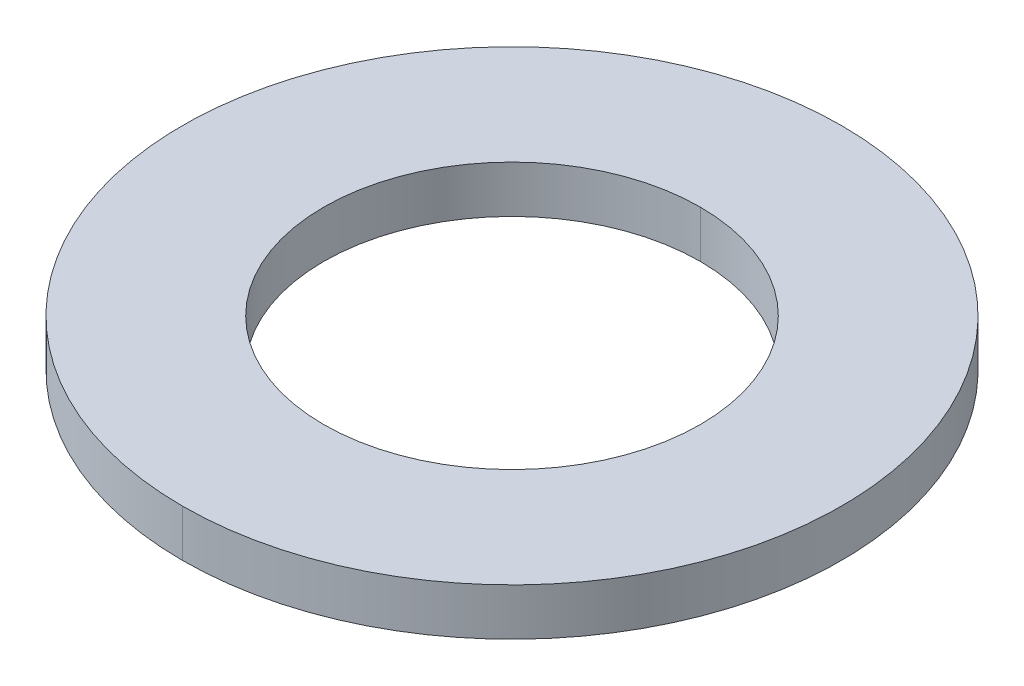
ISO-10303-21;
HEADER;
FILE_DESCRIPTION(('STEP AP214'),'2;1');
FILE_NAME('part.step','',(''),(''),'','','');
FILE_SCHEMA(('AUTOMOTIVE_DESIGN { 1 0 10303 214 1 1 1 1 }'));
ENDSEC;
DATA;
#1=APPLICATION_CONTEXT('core data for automotive mechanical design processes');
#2=APPLICATION_PROTOCOL_DEFINITION('international standard','automotive_design',2000,#1);
#3=PRODUCT_CONTEXT('',#1,'mechanical');
#4=PRODUCT('Part','Part','',(#3));
#5=PRODUCT_RELATED_PRODUCT_CATEGORY('part','',(#4));
#6=PRODUCT_DEFINITION_FORMATION('','',#4);
#7=PRODUCT_DEFINITION_CONTEXT('part definition',#1,'design');
#8=PRODUCT_DEFINITION('design','',#6,#7);
#9=PRODUCT_DEFINITION_SHAPE('','',#8);
#10=(LENGTH_UNIT() NAMED_UNIT(*) SI_UNIT(.MILLI.,.METRE.));
#11=(NAMED_UNIT(*) PLANE_ANGLE_UNIT() SI_UNIT($,.RADIAN.));
#12=(NAMED_UNIT(*) SI_UNIT($,.STERADIAN.) SOLID_ANGLE_UNIT());
#13=UNCERTAINTY_MEASURE_WITH_UNIT(LENGTH_MEASURE(1.E-05),#10,'distance_accuracy_value','');
#14=(GEOMETRIC_REPRESENTATION_CONTEXT(3) GLOBAL_UNCERTAINTY_ASSIGNED_CONTEXT((#13)) GLOBAL_UNIT_ASSIGNED_CONTEXT((#10,
#11,#12)) REPRESENTATION_CONTEXT('',''));
#15=CARTESIAN_POINT('',(0.,0.,0.));
#16=DIRECTION('',(0.,0.,1.));
#17=DIRECTION('',(1.,0.,0.));
#18=AXIS2_PLACEMENT_3D('',#15,#16,#17);
#19=CARTESIAN_POINT('',(0.,0.,0.));
#20=DIRECTION('',(0.,1.,0.));
#21=DIRECTION('',(0.,0.,1.));
#22=AXIS2_PLACEMENT_3D('',#19,#20,#21);
#23=CYLINDRICAL_SURFACE('',#22,4.);
#24=DIRECTION('',(0.,1.,0.));
#25=VECTOR('',#24,1.);
#26=CARTESIAN_POINT('',(0.,0.,-4.));
#27=LINE('',#26,#25);
#28=CARTESIAN_POINT('',(0.,0.,-4.));
#29=VERTEX_POINT('',#28);
#30=CARTESIAN_POINT('',(0.,1.,-4.));
#31=VERTEX_POINT('',#30);
#32=EDGE_CURVE('E20',#29,#31,#27,.T.);
#33=ORIENTED_EDGE('',*,*,#32,.F.);
#34=CARTESIAN_POINT('',(0.,0.,0.));
#35=DIRECTION('',(0.,1.,0.));
#36=DIRECTION('',(0.,0.,1.));
#37=AXIS2_PLACEMENT_3D('',#34,#35,#36);
#38=CIRCLE('',#37,4.);
#39=CARTESIAN_POINT('',(0.,0.,4.));
#40=VERTEX_POINT('',#39);
#41=EDGE_CURVE('E11',#40,#29,#38,.T.);
#42=ORIENTED_EDGE('',*,*,#41,.F.);
#43=DIRECTION('',(0.,1.,0.));
#44=VECTOR('',#43,1.);
#45=CARTESIAN_POINT('',(0.,0.,4.));
#46=LINE('',#45,#44);
#47=CARTESIAN_POINT('',(0.,1.,4.));
#48=VERTEX_POINT('',#47);
#49=EDGE_CURVE('E81',#40,#48,#46,.T.);
#50=ORIENTED_EDGE('',*,*,#49,.T.);
#51=CARTESIAN_POINT('',(0.,1.,0.));
#52=DIRECTION('',(0.,1.,0.));
#53=DIRECTION('',(0.,0.,1.));
#54=AXIS2_PLACEMENT_3D('',#51,#52,#53);
#55=CIRCLE('',#54,4.);
#56=EDGE_CURVE('E26',#48,#31,#55,.T.);
#57=ORIENTED_EDGE('',*,*,#56,.T.);
#58=EDGE_LOOP('',(#33,#42,#50,#57));
#59=FACE_BOUND('',#58,.T.);
#60=ADVANCED_FACE('F16',(#59),#23,.F.);
#61=CARTESIAN_POINT('',(0.,0.,0.));
#62=DIRECTION('',(0.,1.,0.));
#63=DIRECTION('',(1.,0.,0.));
#64=AXIS2_PLACEMENT_3D('',#61,#62,#63);
#65=PLANE('',#64);
#66=ORIENTED_EDGE('',*,*,#41,.T.);
#67=CARTESIAN_POINT('',(0.,0.,0.));
#68=DIRECTION('',(0.,1.,0.));
#69=DIRECTION('',(0.,0.,1.));
#70=AXIS2_PLACEMENT_3D('',#67,#68,#69);
#71=CIRCLE('',#70,4.);
#72=EDGE_CURVE('E88',#29,#40,#71,.T.);
#73=ORIENTED_EDGE('',*,*,#72,.T.);
#74=EDGE_LOOP('',(#66,#73));
#75=FACE_BOUND('',#74,.T.);
#76=CARTESIAN_POINT('',(0.,0.,0.));
#77=DIRECTION('',(0.,1.,0.));
#78=DIRECTION('',(0.,0.,1.));
#79=AXIS2_PLACEMENT_3D('',#76,#77,#78);
#80=CIRCLE('',#79,7.);
#81=CARTESIAN_POINT('',(0.,0.,-7.));
#82=VERTEX_POINT('',#81);
#83=CARTESIAN_POINT('',(0.,0.,7.));
#84=VERTEX_POINT('',#83);
#85=EDGE_CURVE('E39',#82,#84,#80,.T.);
#86=ORIENTED_EDGE('',*,*,#85,.F.);
#87=CARTESIAN_POINT('',(0.,0.,0.));
#88=DIRECTION('',(0.,1.,0.));
#89=DIRECTION('',(0.,0.,1.));
#90=AXIS2_PLACEMENT_3D('',#87,#88,#89);
#91=CIRCLE('',#90,7.);
#92=EDGE_CURVE('E107',#84,#82,#91,.T.);
#93=ORIENTED_EDGE('',*,*,#92,.F.);
#94=EDGE_LOOP('',(#86,#93));
#95=FACE_BOUND('',#94,.T.);
#96=ADVANCED_FACE('F93',(#75,#95),#65,.F.);
#97=CARTESIAN_POINT('',(0.,1.,0.));
#98=DIRECTION('',(0.,1.,0.));
#99=DIRECTION('',(1.,0.,0.));
#100=AXIS2_PLACEMENT_3D('',#97,#98,#99);
#101=PLANE('',#100);
#102=ORIENTED_EDGE('',*,*,#56,.F.);
#103=CARTESIAN_POINT('',(0.,1.,0.));
#104=DIRECTION('',(0.,1.,0.));
#105=DIRECTION('',(0.,0.,1.));
#106=AXIS2_PLACEMENT_3D('',#103,#104,#105);
#107=CIRCLE('',#106,4.);
#108=EDGE_CURVE('E89',#31,#48,#107,.T.);
#109=ORIENTED_EDGE('',*,*,#108,.F.);
#110=EDGE_LOOP('',(#102,#109));
#111=FACE_BOUND('',#110,.T.);
#112=CARTESIAN_POINT('',(0.,1.,0.));
#113=DIRECTION('',(0.,1.,0.));
#114=DIRECTION('',(0.,0.,1.));
#115=AXIS2_PLACEMENT_3D('',#112,#113,#114);
#116=CIRCLE('',#115,7.);
#117=CARTESIAN_POINT('',(0.,1.,-7.));
#118=VERTEX_POINT('',#117);
#119=CARTESIAN_POINT('',(0.,1.,7.));
#120=VERTEX_POINT('',#119);
#121=EDGE_CURVE('E116',#118,#120,#116,.T.);
#122=ORIENTED_EDGE('',*,*,#121,.T.);
#123=CARTESIAN_POINT('',(0.,1.,0.));
#124=DIRECTION('',(0.,1.,0.));
#125=DIRECTION('',(0.,0.,1.));
#126=AXIS2_PLACEMENT_3D('',#123,#124,#125);
#127=CIRCLE('',#126,7.);
#128=EDGE_CURVE('E91',#120,#118,#127,.T.);
#129=ORIENTED_EDGE('',*,*,#128,.T.);
#130=EDGE_LOOP('',(#122,#129));
#131=FACE_BOUND('',#130,.T.);
#132=ADVANCED_FACE('F173',(#111,#131),#101,.T.);
#133=CARTESIAN_POINT('',(0.,1.,0.));
#134=DIRECTION('',(0.,-1.,0.));
#135=DIRECTION('',(0.,0.,-1.));
#136=AXIS2_PLACEMENT_3D('',#133,#134,#135);
#137=CYLINDRICAL_SURFACE('',#136,7.);
#138=DIRECTION('',(0.,-1.,0.));
#139=VECTOR('',#138,1.);
#140=CARTESIAN_POINT('',(0.,1.,7.));
#141=LINE('',#140,#139);
#142=EDGE_CURVE('E103',#120,#84,#141,.T.);
#143=ORIENTED_EDGE('',*,*,#142,.F.);
#144=ORIENTED_EDGE('',*,*,#121,.F.);
#145=DIRECTION('',(0.,-1.,0.));
#146=VECTOR('',#145,1.);
#147=CARTESIAN_POINT('',(0.,1.,-7.));
#148=LINE('',#147,#146);
#149=EDGE_CURVE('E114',#118,#82,#148,.T.);
#150=ORIENTED_EDGE('',*,*,#149,.T.);
#151=ORIENTED_EDGE('',*,*,#85,.T.);
#152=EDGE_LOOP('',(#143,#144,#150,#151));
#153=FACE_BOUND('',#152,.T.);
#154=ADVANCED_FACE('F160',(#153),#137,.T.);
#155=CARTESIAN_POINT('',(0.,1.,0.));
#156=DIRECTION('',(0.,-1.,0.));
#157=DIRECTION('',(0.,0.,-1.));
#158=AXIS2_PLACEMENT_3D('',#155,#156,#157);
#159=CYLINDRICAL_SURFACE('',#158,7.);
#160=ORIENTED_EDGE('',*,*,#128,.F.);
#161=ORIENTED_EDGE('',*,*,#142,.T.);
#162=ORIENTED_EDGE('',*,*,#92,.T.);
#163=ORIENTED_EDGE('',*,*,#149,.F.);
#164=EDGE_LOOP('',(#160,#161,#162,#163));
#165=FACE_BOUND('',#164,.T.);
#166=ADVANCED_FACE('F148',(#165),#159,.T.);
#167=CARTESIAN_POINT('',(0.,0.,0.));
#168=DIRECTION('',(0.,1.,0.));
#169=DIRECTION('',(0.,0.,1.));
#170=AXIS2_PLACEMENT_3D('',#167,#168,#169);
#171=CYLINDRICAL_SURFACE('',#170,4.);
#172=ORIENTED_EDGE('',*,*,#72,.F.);
#173=ORIENTED_EDGE('',*,*,#32,.T.);
#174=ORIENTED_EDGE('',*,*,#108,.T.);
#175=ORIENTED_EDGE('',*,*,#49,.F.);
#176=EDGE_LOOP('',(#172,#173,#174,#175));
#177=FACE_BOUND('',#176,.T.);
#178=ADVANCED_FACE('F18',(#177),#171,.F.);
#179=CLOSED_SHELL('',(#60,#96,#132,#154,#166,#178));
#180=MANIFOLD_SOLID_BREP('B1',#179);
#181=ADVANCED_BREP_SHAPE_REPRESENTATION('',(#18,#180),#14);
#182=SHAPE_DEFINITION_REPRESENTATION(#9,#181);
ENDSEC;
END-ISO-10303-21;
